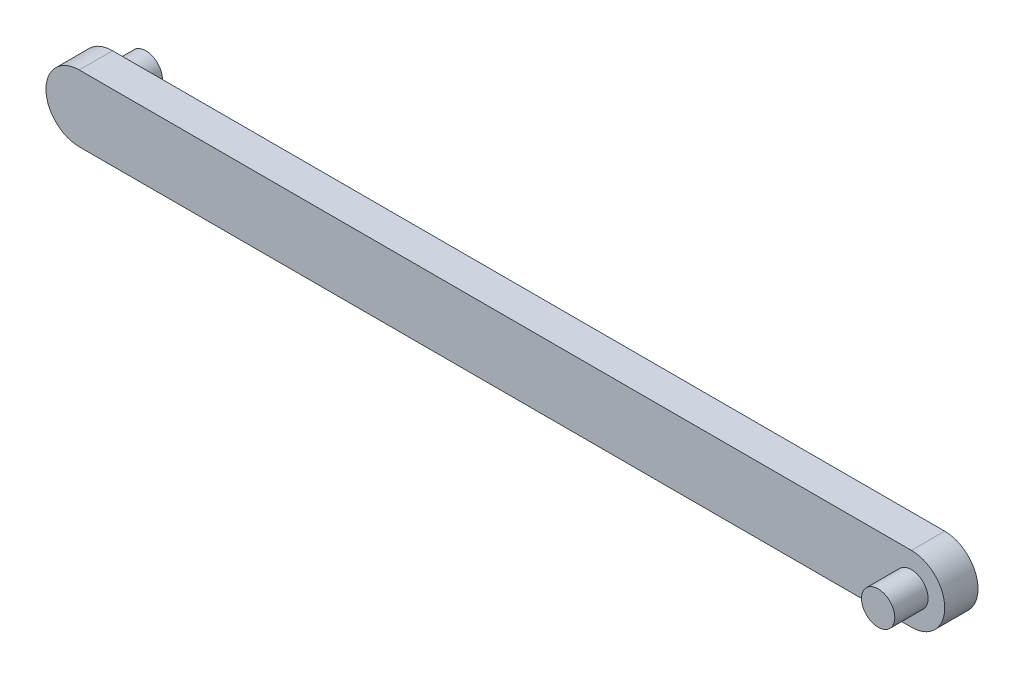
ISO-10303-21;
HEADER;
FILE_DESCRIPTION(('STEP AP214'),'2;1');
FILE_NAME('part.step','',(''),(''),'','','');
FILE_SCHEMA(('AUTOMOTIVE_DESIGN { 1 0 10303 214 1 1 1 1 }'));
ENDSEC;
DATA;
#1=APPLICATION_CONTEXT('core data for automotive mechanical design processes');
#2=APPLICATION_PROTOCOL_DEFINITION('international standard','automotive_design',2000,#1);
#3=PRODUCT_CONTEXT('',#1,'mechanical');
#4=PRODUCT('Part','Part','',(#3));
#5=PRODUCT_RELATED_PRODUCT_CATEGORY('part','',(#4));
#6=PRODUCT_DEFINITION_FORMATION('','',#4);
#7=PRODUCT_DEFINITION_CONTEXT('part definition',#1,'design');
#8=PRODUCT_DEFINITION('design','',#6,#7);
#9=PRODUCT_DEFINITION_SHAPE('','',#8);
#10=(LENGTH_UNIT() NAMED_UNIT(*) SI_UNIT(.MILLI.,.METRE.));
#11=(NAMED_UNIT(*) PLANE_ANGLE_UNIT() SI_UNIT($,.RADIAN.));
#12=(NAMED_UNIT(*) SI_UNIT($,.STERADIAN.) SOLID_ANGLE_UNIT());
#13=UNCERTAINTY_MEASURE_WITH_UNIT(LENGTH_MEASURE(1.E-05),#10,'distance_accuracy_value','');
#14=(GEOMETRIC_REPRESENTATION_CONTEXT(3) GLOBAL_UNCERTAINTY_ASSIGNED_CONTEXT((#13)) GLOBAL_UNIT_ASSIGNED_CONTEXT((#10,
#11,#12)) REPRESENTATION_CONTEXT('',''));
#15=CARTESIAN_POINT('',(0.,0.,0.));
#16=DIRECTION('',(0.,0.,1.));
#17=DIRECTION('',(1.,0.,0.));
#18=AXIS2_PLACEMENT_3D('',#15,#16,#17);
#19=CARTESIAN_POINT('',(-16.3911096260331,0.,0.));
#20=DIRECTION('',(0.,0.,1.));
#21=DIRECTION('',(1.,0.,0.));
#22=AXIS2_PLACEMENT_3D('',#19,#20,#21);
#23=PLANE('',#22);
#24=CARTESIAN_POINT('',(-16.3911096260331,0.,0.));
#25=DIRECTION('',(0.,0.,1.));
#26=DIRECTION('',(1.,0.,0.));
#27=AXIS2_PLACEMENT_3D('',#24,#25,#26);
#28=CIRCLE('',#27,2.);
#29=CARTESIAN_POINT('',(-16.3911096260331,2.,0.));
#30=VERTEX_POINT('',#29);
#31=CARTESIAN_POINT('',(-16.3911096260331,-2.,0.));
#32=VERTEX_POINT('',#31);
#33=EDGE_CURVE('E99',#30,#32,#28,.T.);
#34=ORIENTED_EDGE('',*,*,#33,.F.);
#35=DIRECTION('',(-1.,0.,0.));
#36=VECTOR('',#35,1.);
#37=CARTESIAN_POINT('',(-16.3911096260331,2.,0.));
#38=LINE('',#37,#36);
#39=CARTESIAN_POINT('',(33.6088903739669,2.,0.));
#40=VERTEX_POINT('',#39);
#41=EDGE_CURVE('E71',#40,#30,#38,.T.);
#42=ORIENTED_EDGE('',*,*,#41,.F.);
#43=CARTESIAN_POINT('',(33.6088903739669,0.,0.));
#44=DIRECTION('',(0.,0.,1.));
#45=DIRECTION('',(1.,0.,0.));
#46=AXIS2_PLACEMENT_3D('',#43,#44,#45);
#47=CIRCLE('',#46,2.);
#48=CARTESIAN_POINT('',(33.6088903739669,-2.,0.));
#49=VERTEX_POINT('',#48);
#50=EDGE_CURVE('E65',#49,#40,#47,.T.);
#51=ORIENTED_EDGE('',*,*,#50,.F.);
#52=DIRECTION('',(1.,0.,0.));
#53=VECTOR('',#52,1.);
#54=CARTESIAN_POINT('',(-16.3911096260331,-2.,0.));
#55=LINE('',#54,#53);
#56=EDGE_CURVE('E90',#32,#49,#55,.T.);
#57=ORIENTED_EDGE('',*,*,#56,.F.);
#58=EDGE_LOOP('',(#34,#42,#51,#57));
#59=FACE_BOUND('',#58,.T.);
#60=CARTESIAN_POINT('',(-16.3911096260331,0.,0.));
#61=DIRECTION('',(0.,0.,1.));
#62=DIRECTION('',(1.,0.,0.));
#63=AXIS2_PLACEMENT_3D('',#60,#61,#62);
#64=CIRCLE('',#63,1.);
#65=CARTESIAN_POINT('',(-15.3911096260331,0.,0.));
#66=VERTEX_POINT('',#65);
#67=EDGE_CURVE('E11',#66,#66,#64,.F.);
#68=ORIENTED_EDGE('',*,*,#67,.F.);
#69=EDGE_LOOP('',(#68));
#70=FACE_BOUND('',#69,.T.);
#71=ADVANCED_FACE('F31',(#59,#70),#23,.F.);
#72=CARTESIAN_POINT('',(-16.3911096260331,0.,2.));
#73=DIRECTION('',(0.,0.,1.));
#74=DIRECTION('',(1.,0.,0.));
#75=AXIS2_PLACEMENT_3D('',#72,#73,#74);
#76=PLANE('',#75);
#77=CARTESIAN_POINT('',(-16.3911096260331,0.,2.));
#78=DIRECTION('',(0.,0.,1.));
#79=DIRECTION('',(1.,0.,0.));
#80=AXIS2_PLACEMENT_3D('',#77,#78,#79);
#81=CIRCLE('',#80,2.);
#82=CARTESIAN_POINT('',(-16.3911096260331,2.,2.));
#83=VERTEX_POINT('',#82);
#84=CARTESIAN_POINT('',(-16.3911096260331,-2.,2.));
#85=VERTEX_POINT('',#84);
#86=EDGE_CURVE('E85',#83,#85,#81,.T.);
#87=ORIENTED_EDGE('',*,*,#86,.T.);
#88=DIRECTION('',(1.,0.,0.));
#89=VECTOR('',#88,1.);
#90=CARTESIAN_POINT('',(-16.3911096260331,-2.,2.));
#91=LINE('',#90,#89);
#92=CARTESIAN_POINT('',(33.6088903739669,-2.,2.));
#93=VERTEX_POINT('',#92);
#94=EDGE_CURVE('E79',#85,#93,#91,.T.);
#95=ORIENTED_EDGE('',*,*,#94,.T.);
#96=CARTESIAN_POINT('',(33.6088903739669,0.,2.));
#97=DIRECTION('',(0.,0.,1.));
#98=DIRECTION('',(1.,0.,0.));
#99=AXIS2_PLACEMENT_3D('',#96,#97,#98);
#100=CIRCLE('',#99,2.);
#101=CARTESIAN_POINT('',(33.6088903739669,2.,2.));
#102=VERTEX_POINT('',#101);
#103=EDGE_CURVE('E83',#93,#102,#100,.T.);
#104=ORIENTED_EDGE('',*,*,#103,.T.);
#105=DIRECTION('',(-1.,0.,0.));
#106=VECTOR('',#105,1.);
#107=CARTESIAN_POINT('',(-16.3911096260331,2.,2.));
#108=LINE('',#107,#106);
#109=EDGE_CURVE('E48',#102,#83,#108,.T.);
#110=ORIENTED_EDGE('',*,*,#109,.T.);
#111=EDGE_LOOP('',(#87,#95,#104,#110));
#112=FACE_BOUND('',#111,.T.);
#113=CARTESIAN_POINT('',(33.6088903739669,0.,2.));
#114=DIRECTION('',(0.,0.,1.));
#115=DIRECTION('',(1.,0.,0.));
#116=AXIS2_PLACEMENT_3D('',#113,#114,#115);
#117=CIRCLE('',#116,0.999999999999998);
#118=CARTESIAN_POINT('',(34.6088903739669,0.,2.));
#119=VERTEX_POINT('',#118);
#120=EDGE_CURVE('E206',#119,#119,#117,.T.);
#121=ORIENTED_EDGE('',*,*,#120,.F.);
#122=EDGE_LOOP('',(#121));
#123=FACE_BOUND('',#122,.T.);
#124=ADVANCED_FACE('F80',(#112,#123),#76,.T.);
#125=CARTESIAN_POINT('',(-16.3911096260331,0.,2.));
#126=DIRECTION('',(0.,0.,-1.));
#127=DIRECTION('',(-1.,0.,0.));
#128=AXIS2_PLACEMENT_3D('',#125,#126,#127);
#129=CYLINDRICAL_SURFACE('',#128,2.);
#130=ORIENTED_EDGE('',*,*,#33,.T.);
#131=DIRECTION('',(0.,0.,-1.));
#132=VECTOR('',#131,1.);
#133=CARTESIAN_POINT('',(-16.3911096260331,-2.,2.));
#134=LINE('',#133,#132);
#135=EDGE_CURVE('E40',#85,#32,#134,.T.);
#136=ORIENTED_EDGE('',*,*,#135,.F.);
#137=ORIENTED_EDGE('',*,*,#86,.F.);
#138=DIRECTION('',(0.,0.,-1.));
#139=VECTOR('',#138,1.);
#140=CARTESIAN_POINT('',(-16.3911096260331,2.,2.));
#141=LINE('',#140,#139);
#142=EDGE_CURVE('E95',#83,#30,#141,.T.);
#143=ORIENTED_EDGE('',*,*,#142,.T.);
#144=EDGE_LOOP('',(#130,#136,#137,#143));
#145=FACE_BOUND('',#144,.T.);
#146=ADVANCED_FACE('F33',(#145),#129,.T.);
#147=CARTESIAN_POINT('',(-16.3911096260331,-2.,2.));
#148=DIRECTION('',(0.,1.,0.));
#149=DIRECTION('',(0.,0.,1.));
#150=AXIS2_PLACEMENT_3D('',#147,#148,#149);
#151=PLANE('',#150);
#152=ORIENTED_EDGE('',*,*,#56,.T.);
#153=DIRECTION('',(0.,0.,-1.));
#154=VECTOR('',#153,1.);
#155=CARTESIAN_POINT('',(33.6088903739669,-2.,2.));
#156=LINE('',#155,#154);
#157=EDGE_CURVE('E88',#93,#49,#156,.T.);
#158=ORIENTED_EDGE('',*,*,#157,.F.);
#159=ORIENTED_EDGE('',*,*,#94,.F.);
#160=ORIENTED_EDGE('',*,*,#135,.T.);
#161=EDGE_LOOP('',(#152,#158,#159,#160));
#162=FACE_BOUND('',#161,.T.);
#163=ADVANCED_FACE('F89',(#162),#151,.F.);
#164=CARTESIAN_POINT('',(33.6088903739669,0.,2.));
#165=DIRECTION('',(0.,0.,-1.));
#166=DIRECTION('',(-1.,0.,0.));
#167=AXIS2_PLACEMENT_3D('',#164,#165,#166);
#168=CYLINDRICAL_SURFACE('',#167,2.);
#169=ORIENTED_EDGE('',*,*,#50,.T.);
#170=DIRECTION('',(0.,0.,-1.));
#171=VECTOR('',#170,1.);
#172=CARTESIAN_POINT('',(33.6088903739669,2.,2.));
#173=LINE('',#172,#171);
#174=EDGE_CURVE('E91',#102,#40,#173,.T.);
#175=ORIENTED_EDGE('',*,*,#174,.F.);
#176=ORIENTED_EDGE('',*,*,#103,.F.);
#177=ORIENTED_EDGE('',*,*,#157,.T.);
#178=EDGE_LOOP('',(#169,#175,#176,#177));
#179=FACE_BOUND('',#178,.T.);
#180=ADVANCED_FACE('F93',(#179),#168,.T.);
#181=CARTESIAN_POINT('',(-16.3911096260331,2.,2.));
#182=DIRECTION('',(0.,-1.,0.));
#183=DIRECTION('',(0.,0.,-1.));
#184=AXIS2_PLACEMENT_3D('',#181,#182,#183);
#185=PLANE('',#184);
#186=ORIENTED_EDGE('',*,*,#41,.T.);
#187=ORIENTED_EDGE('',*,*,#142,.F.);
#188=ORIENTED_EDGE('',*,*,#109,.F.);
#189=ORIENTED_EDGE('',*,*,#174,.T.);
#190=EDGE_LOOP('',(#186,#187,#188,#189));
#191=FACE_BOUND('',#190,.T.);
#192=ADVANCED_FACE('F134',(#191),#185,.F.);
#193=CARTESIAN_POINT('',(33.6088903739669,0.,4.));
#194=DIRECTION('',(0.,0.,-1.));
#195=DIRECTION('',(-1.,0.,0.));
#196=AXIS2_PLACEMENT_3D('',#193,#194,#195);
#197=CYLINDRICAL_SURFACE('',#196,0.999999999999998);
#198=CARTESIAN_POINT('',(33.6088903739669,0.,4.));
#199=DIRECTION('',(0.,0.,1.));
#200=DIRECTION('',(1.,0.,0.));
#201=AXIS2_PLACEMENT_3D('',#198,#199,#200);
#202=CIRCLE('',#201,0.999999999999998);
#203=CARTESIAN_POINT('',(34.6088903739669,0.,4.));
#204=VERTEX_POINT('',#203);
#205=EDGE_CURVE('E102',#204,#204,#202,.T.);
#206=ORIENTED_EDGE('',*,*,#205,.F.);
#207=EDGE_LOOP('',(#206));
#208=FACE_BOUND('',#207,.T.);
#209=ORIENTED_EDGE('',*,*,#120,.T.);
#210=EDGE_LOOP('',(#209));
#211=FACE_BOUND('',#210,.T.);
#212=ADVANCED_FACE('F127',(#208,#211),#197,.T.);
#213=CARTESIAN_POINT('',(33.6088903739669,0.,4.));
#214=DIRECTION('',(0.,0.,1.));
#215=DIRECTION('',(1.,0.,0.));
#216=AXIS2_PLACEMENT_3D('',#213,#214,#215);
#217=PLANE('',#216);
#218=ORIENTED_EDGE('',*,*,#205,.T.);
#219=EDGE_LOOP('',(#218));
#220=FACE_BOUND('',#219,.T.);
#221=ADVANCED_FACE('F118',(#220),#217,.T.);
#222=CARTESIAN_POINT('',(-16.3911096260331,0.,-2.));
#223=DIRECTION('',(0.,0.,1.));
#224=DIRECTION('',(1.,0.,0.));
#225=AXIS2_PLACEMENT_3D('',#222,#223,#224);
#226=CYLINDRICAL_SURFACE('',#225,1.);
#227=CARTESIAN_POINT('',(-16.3911096260331,0.,-2.));
#228=DIRECTION('',(0.,0.,-1.));
#229=DIRECTION('',(-1.,0.,0.));
#230=AXIS2_PLACEMENT_3D('',#227,#228,#229);
#231=CIRCLE('',#230,1.);
#232=CARTESIAN_POINT('',(-17.3911096260331,0.,-2.));
#233=VERTEX_POINT('',#232);
#234=EDGE_CURVE('E207',#233,#233,#231,.T.);
#235=ORIENTED_EDGE('',*,*,#234,.F.);
#236=EDGE_LOOP('',(#235));
#237=FACE_BOUND('',#236,.T.);
#238=ORIENTED_EDGE('',*,*,#67,.T.);
#239=EDGE_LOOP('',(#238));
#240=FACE_BOUND('',#239,.T.);
#241=ADVANCED_FACE('F115',(#237,#240),#226,.T.);
#242=CARTESIAN_POINT('',(-16.3911096260331,0.,-2.));
#243=DIRECTION('',(0.,0.,-1.));
#244=DIRECTION('',(-1.,0.,0.));
#245=AXIS2_PLACEMENT_3D('',#242,#243,#244);
#246=PLANE('',#245);
#247=ORIENTED_EDGE('',*,*,#234,.T.);
#248=EDGE_LOOP('',(#247));
#249=FACE_BOUND('',#248,.T.);
#250=ADVANCED_FACE('F117',(#249),#246,.T.);
#251=CLOSED_SHELL('',(#71,#124,#146,#163,#180,#192,#212,#221,#241,#250));
#252=MANIFOLD_SOLID_BREP('B2',#251);
#253=ADVANCED_BREP_SHAPE_REPRESENTATION('',(#18,#252),#14);
#254=SHAPE_DEFINITION_REPRESENTATION(#9,#253);
ENDSEC;
END-ISO-10303-21;
